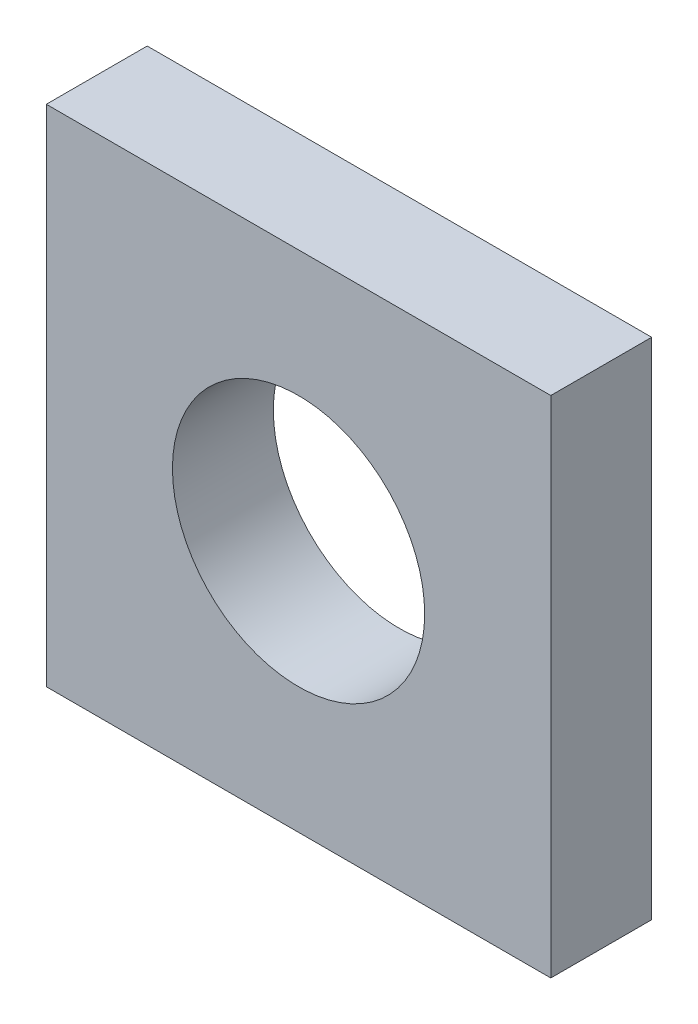
ISO-10303-21;
HEADER;
FILE_DESCRIPTION(('STEP AP214'),'2;1');
FILE_NAME('part.step','',(''),(''),'','','');
FILE_SCHEMA(('AUTOMOTIVE_DESIGN { 1 0 10303 214 1 1 1 1 }'));
ENDSEC;
DATA;
#1=APPLICATION_CONTEXT('core data for automotive mechanical design processes');
#2=APPLICATION_PROTOCOL_DEFINITION('international standard','automotive_design',2000,#1);
#3=PRODUCT_CONTEXT('',#1,'mechanical');
#4=PRODUCT('Part','Part','',(#3));
#5=PRODUCT_RELATED_PRODUCT_CATEGORY('part','',(#4));
#6=PRODUCT_DEFINITION_FORMATION('','',#4);
#7=PRODUCT_DEFINITION_CONTEXT('part definition',#1,'design');
#8=PRODUCT_DEFINITION('design','',#6,#7);
#9=PRODUCT_DEFINITION_SHAPE('','',#8);
#10=(LENGTH_UNIT() NAMED_UNIT(*) SI_UNIT(.MILLI.,.METRE.));
#11=(NAMED_UNIT(*) PLANE_ANGLE_UNIT() SI_UNIT($,.RADIAN.));
#12=(NAMED_UNIT(*) SI_UNIT($,.STERADIAN.) SOLID_ANGLE_UNIT());
#13=UNCERTAINTY_MEASURE_WITH_UNIT(LENGTH_MEASURE(1.E-05),#10,'distance_accuracy_value','');
#14=(GEOMETRIC_REPRESENTATION_CONTEXT(3) GLOBAL_UNCERTAINTY_ASSIGNED_CONTEXT((#13)) GLOBAL_UNIT_ASSIGNED_CONTEXT((#10,
#11,#12)) REPRESENTATION_CONTEXT('',''));
#15=CARTESIAN_POINT('',(0.,0.,0.));
#16=DIRECTION('',(0.,0.,1.));
#17=DIRECTION('',(1.,0.,0.));
#18=AXIS2_PLACEMENT_3D('',#15,#16,#17);
#19=CARTESIAN_POINT('',(0.,0.,5.));
#20=DIRECTION('',(0.,0.,1.));
#21=DIRECTION('',(1.,0.,0.));
#22=AXIS2_PLACEMENT_3D('',#19,#20,#21);
#23=PLANE('',#22);
#24=DIRECTION('',(0.,1.,0.));
#25=VECTOR('',#24,1.);
#26=CARTESIAN_POINT('',(-27.5683849552241,-19.4875535803547,5.));
#27=LINE('',#26,#25);
#28=CARTESIAN_POINT('',(-27.568384955224,-69.4875535803547,5.));
#29=VERTEX_POINT('',#28);
#30=CARTESIAN_POINT('',(-27.5683849552241,-19.4875535803547,5.));
#31=VERTEX_POINT('',#30);
#32=EDGE_CURVE('E92',#29,#31,#27,.T.);
#33=ORIENTED_EDGE('',*,*,#32,.T.);
#34=DIRECTION('',(-1.,0.,0.));
#35=VECTOR('',#34,1.);
#36=CARTESIAN_POINT('',(-77.5683849552241,-19.4875535803547,5.));
#37=LINE('',#36,#35);
#38=CARTESIAN_POINT('',(-77.5683849552241,-19.4875535803547,5.));
#39=VERTEX_POINT('',#38);
#40=EDGE_CURVE('E87',#31,#39,#37,.T.);
#41=ORIENTED_EDGE('',*,*,#40,.T.);
#42=DIRECTION('',(0.,-1.,0.));
#43=VECTOR('',#42,1.);
#44=CARTESIAN_POINT('',(-77.5683849552241,-19.4875535803547,5.));
#45=LINE('',#44,#43);
#46=CARTESIAN_POINT('',(-77.5683849552241,-69.4875535803547,5.));
#47=VERTEX_POINT('',#46);
#48=EDGE_CURVE('E90',#39,#47,#45,.T.);
#49=ORIENTED_EDGE('',*,*,#48,.T.);
#50=DIRECTION('',(1.,0.,0.));
#51=VECTOR('',#50,1.);
#52=CARTESIAN_POINT('',(-77.5683849552241,-69.4875535803547,5.));
#53=LINE('',#52,#51);
#54=EDGE_CURVE('E57',#47,#29,#53,.T.);
#55=ORIENTED_EDGE('',*,*,#54,.T.);
#56=EDGE_LOOP('',(#33,#41,#49,#55));
#57=FACE_BOUND('',#56,.T.);
#58=CARTESIAN_POINT('',(-52.5683849552241,-44.4875535803547,5.));
#59=DIRECTION('',(0.,0.,1.));
#60=DIRECTION('',(1.,0.,0.));
#61=AXIS2_PLACEMENT_3D('',#58,#59,#60);
#62=CIRCLE('',#61,12.5);
#63=CARTESIAN_POINT('',(-40.0683849552241,-44.4875535803547,5.));
#64=VERTEX_POINT('',#63);
#65=EDGE_CURVE('E112',#64,#64,#62,.T.);
#66=ORIENTED_EDGE('',*,*,#65,.F.);
#67=EDGE_LOOP('',(#66));
#68=FACE_BOUND('',#67,.T.);
#69=ADVANCED_FACE('F39',(#57,#68),#23,.T.);
#70=CARTESIAN_POINT('',(0.,0.,-5.));
#71=DIRECTION('',(0.,0.,1.));
#72=DIRECTION('',(1.,0.,0.));
#73=AXIS2_PLACEMENT_3D('',#70,#71,#72);
#74=PLANE('',#73);
#75=DIRECTION('',(0.,1.,0.));
#76=VECTOR('',#75,1.);
#77=CARTESIAN_POINT('',(-27.5683849552241,-19.4875535803547,-5.));
#78=LINE('',#77,#76);
#79=CARTESIAN_POINT('',(-27.568384955224,-69.4875535803547,-5.));
#80=VERTEX_POINT('',#79);
#81=CARTESIAN_POINT('',(-27.5683849552241,-19.4875535803547,-5.));
#82=VERTEX_POINT('',#81);
#83=EDGE_CURVE('E108',#80,#82,#78,.T.);
#84=ORIENTED_EDGE('',*,*,#83,.F.);
#85=DIRECTION('',(1.,0.,0.));
#86=VECTOR('',#85,1.);
#87=CARTESIAN_POINT('',(-77.5683849552241,-69.4875535803547,-5.));
#88=LINE('',#87,#86);
#89=CARTESIAN_POINT('',(-77.5683849552241,-69.4875535803547,-5.));
#90=VERTEX_POINT('',#89);
#91=EDGE_CURVE('E80',#90,#80,#88,.T.);
#92=ORIENTED_EDGE('',*,*,#91,.F.);
#93=DIRECTION('',(0.,-1.,0.));
#94=VECTOR('',#93,1.);
#95=CARTESIAN_POINT('',(-77.5683849552241,-19.4875535803547,-5.));
#96=LINE('',#95,#94);
#97=CARTESIAN_POINT('',(-77.5683849552241,-19.4875535803547,-5.));
#98=VERTEX_POINT('',#97);
#99=EDGE_CURVE('E74',#98,#90,#96,.T.);
#100=ORIENTED_EDGE('',*,*,#99,.F.);
#101=DIRECTION('',(-1.,0.,0.));
#102=VECTOR('',#101,1.);
#103=CARTESIAN_POINT('',(-77.5683849552241,-19.4875535803547,-5.));
#104=LINE('',#103,#102);
#105=EDGE_CURVE('E97',#82,#98,#104,.T.);
#106=ORIENTED_EDGE('',*,*,#105,.F.);
#107=EDGE_LOOP('',(#84,#92,#100,#106));
#108=FACE_BOUND('',#107,.T.);
#109=CARTESIAN_POINT('',(-52.5683849552241,-44.4875535803547,-5.));
#110=DIRECTION('',(0.,0.,1.));
#111=DIRECTION('',(1.,0.,0.));
#112=AXIS2_PLACEMENT_3D('',#109,#110,#111);
#113=CIRCLE('',#112,12.5);
#114=CARTESIAN_POINT('',(-40.0683849552241,-44.4875535803547,-5.));
#115=VERTEX_POINT('',#114);
#116=EDGE_CURVE('E130',#115,#115,#113,.T.);
#117=ORIENTED_EDGE('',*,*,#116,.T.);
#118=EDGE_LOOP('',(#117));
#119=FACE_BOUND('',#118,.T.);
#120=ADVANCED_FACE('F125',(#108,#119),#74,.F.);
#121=CARTESIAN_POINT('',(-27.5683849552241,-19.4875535803547,5.));
#122=DIRECTION('',(-1.,0.,0.));
#123=DIRECTION('',(0.,-1.,0.));
#124=AXIS2_PLACEMENT_3D('',#121,#122,#123);
#125=PLANE('',#124);
#126=ORIENTED_EDGE('',*,*,#83,.T.);
#127=DIRECTION('',(0.,0.,-1.));
#128=VECTOR('',#127,1.);
#129=CARTESIAN_POINT('',(-27.5683849552241,-19.4875535803547,5.));
#130=LINE('',#129,#128);
#131=EDGE_CURVE('E11',#31,#82,#130,.T.);
#132=ORIENTED_EDGE('',*,*,#131,.F.);
#133=ORIENTED_EDGE('',*,*,#32,.F.);
#134=DIRECTION('',(0.,0.,-1.));
#135=VECTOR('',#134,1.);
#136=CARTESIAN_POINT('',(-27.568384955224,-69.4875535803547,5.));
#137=LINE('',#136,#135);
#138=EDGE_CURVE('E104',#29,#80,#137,.T.);
#139=ORIENTED_EDGE('',*,*,#138,.T.);
#140=EDGE_LOOP('',(#126,#132,#133,#139));
#141=FACE_BOUND('',#140,.T.);
#142=ADVANCED_FACE('F41',(#141),#125,.F.);
#143=CARTESIAN_POINT('',(-77.5683849552241,-19.4875535803547,5.));
#144=DIRECTION('',(0.,-1.,0.));
#145=DIRECTION('',(0.,0.,-1.));
#146=AXIS2_PLACEMENT_3D('',#143,#144,#145);
#147=PLANE('',#146);
#148=ORIENTED_EDGE('',*,*,#105,.T.);
#149=DIRECTION('',(0.,0.,-1.));
#150=VECTOR('',#149,1.);
#151=CARTESIAN_POINT('',(-77.5683849552241,-19.4875535803547,5.));
#152=LINE('',#151,#150);
#153=EDGE_CURVE('E49',#39,#98,#152,.T.);
#154=ORIENTED_EDGE('',*,*,#153,.F.);
#155=ORIENTED_EDGE('',*,*,#40,.F.);
#156=ORIENTED_EDGE('',*,*,#131,.T.);
#157=EDGE_LOOP('',(#148,#154,#155,#156));
#158=FACE_BOUND('',#157,.T.);
#159=ADVANCED_FACE('F96',(#158),#147,.F.);
#160=CARTESIAN_POINT('',(-77.5683849552241,-19.4875535803547,5.));
#161=DIRECTION('',(1.,0.,0.));
#162=DIRECTION('',(0.,0.,-1.));
#163=AXIS2_PLACEMENT_3D('',#160,#161,#162);
#164=PLANE('',#163);
#165=ORIENTED_EDGE('',*,*,#99,.T.);
#166=DIRECTION('',(0.,0.,-1.));
#167=VECTOR('',#166,1.);
#168=CARTESIAN_POINT('',(-77.5683849552241,-69.4875535803547,5.));
#169=LINE('',#168,#167);
#170=EDGE_CURVE('E99',#47,#90,#169,.T.);
#171=ORIENTED_EDGE('',*,*,#170,.F.);
#172=ORIENTED_EDGE('',*,*,#48,.F.);
#173=ORIENTED_EDGE('',*,*,#153,.T.);
#174=EDGE_LOOP('',(#165,#171,#172,#173));
#175=FACE_BOUND('',#174,.T.);
#176=ADVANCED_FACE('F100',(#175),#164,.F.);
#177=CARTESIAN_POINT('',(-77.5683849552241,-69.4875535803547,5.));
#178=DIRECTION('',(0.,1.,0.));
#179=DIRECTION('',(0.,0.,1.));
#180=AXIS2_PLACEMENT_3D('',#177,#178,#179);
#181=PLANE('',#180);
#182=ORIENTED_EDGE('',*,*,#91,.T.);
#183=ORIENTED_EDGE('',*,*,#138,.F.);
#184=ORIENTED_EDGE('',*,*,#54,.F.);
#185=ORIENTED_EDGE('',*,*,#170,.T.);
#186=EDGE_LOOP('',(#182,#183,#184,#185));
#187=FACE_BOUND('',#186,.T.);
#188=ADVANCED_FACE('F122',(#187),#181,.F.);
#189=CARTESIAN_POINT('',(-52.5683849552241,-44.4875535803547,5.));
#190=DIRECTION('',(0.,0.,-1.));
#191=DIRECTION('',(-1.,0.,0.));
#192=AXIS2_PLACEMENT_3D('',#189,#190,#191);
#193=CYLINDRICAL_SURFACE('',#192,12.5);
#194=ORIENTED_EDGE('',*,*,#65,.T.);
#195=EDGE_LOOP('',(#194));
#196=FACE_BOUND('',#195,.T.);
#197=ORIENTED_EDGE('',*,*,#116,.F.);
#198=EDGE_LOOP('',(#197));
#199=FACE_BOUND('',#198,.T.);
#200=ADVANCED_FACE('F138',(#196,#199),#193,.F.);
#201=CLOSED_SHELL('',(#69,#120,#142,#159,#176,#188,#200));
#202=MANIFOLD_SOLID_BREP('B2',#201);
#203=ADVANCED_BREP_SHAPE_REPRESENTATION('',(#18,#202),#14);
#204=SHAPE_DEFINITION_REPRESENTATION(#9,#203);
ENDSEC;
END-ISO-10303-21;
